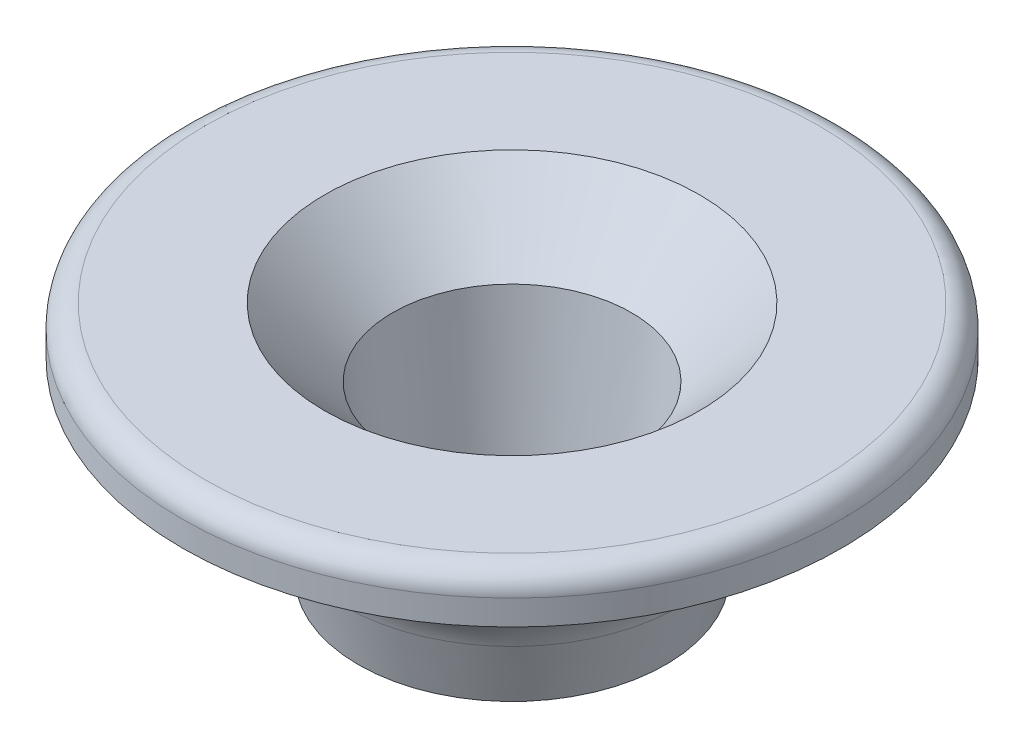
ISO-10303-21;
HEADER;
FILE_DESCRIPTION(('STEP AP214'),'2;1');
FILE_NAME('part.step','',(''),(''),'','','');
FILE_SCHEMA(('AUTOMOTIVE_DESIGN { 1 0 10303 214 1 1 1 1 }'));
ENDSEC;
DATA;
#1=APPLICATION_CONTEXT('core data for automotive mechanical design processes');
#2=APPLICATION_PROTOCOL_DEFINITION('international standard','automotive_design',2000,#1);
#3=PRODUCT_CONTEXT('',#1,'mechanical');
#4=PRODUCT('Part','Part','',(#3));
#5=PRODUCT_RELATED_PRODUCT_CATEGORY('part','',(#4));
#6=PRODUCT_DEFINITION_FORMATION('','',#4);
#7=PRODUCT_DEFINITION_CONTEXT('part definition',#1,'design');
#8=PRODUCT_DEFINITION('design','',#6,#7);
#9=PRODUCT_DEFINITION_SHAPE('','',#8);
#10=(LENGTH_UNIT() NAMED_UNIT(*) SI_UNIT(.MILLI.,.METRE.));
#11=(NAMED_UNIT(*) PLANE_ANGLE_UNIT() SI_UNIT($,.RADIAN.));
#12=(NAMED_UNIT(*) SI_UNIT($,.STERADIAN.) SOLID_ANGLE_UNIT());
#13=UNCERTAINTY_MEASURE_WITH_UNIT(LENGTH_MEASURE(1.E-05),#10,'distance_accuracy_value','');
#14=(GEOMETRIC_REPRESENTATION_CONTEXT(3) GLOBAL_UNCERTAINTY_ASSIGNED_CONTEXT((#13)) GLOBAL_UNIT_ASSIGNED_CONTEXT((#10,
#11,#12)) REPRESENTATION_CONTEXT('',''));
#15=CARTESIAN_POINT('',(0.,0.,0.));
#16=DIRECTION('',(0.,0.,1.));
#17=DIRECTION('',(1.,0.,0.));
#18=AXIS2_PLACEMENT_3D('',#15,#16,#17);
#19=CARTESIAN_POINT('',(0.,3.8884018101044,0.));
#20=DIRECTION('',(0.,1.,0.));
#21=DIRECTION('',(0.,0.,1.));
#22=AXIS2_PLACEMENT_3D('',#19,#20,#21);
#23=CONICAL_SURFACE('',#22,4.4,0.114363653422904);
#24=CARTESIAN_POINT('',(0.,4.44545907102091,0.));
#25=DIRECTION('',(0.,-1.,0.));
#26=DIRECTION('',(0.,0.,-1.));
#27=AXIS2_PLACEMENT_3D('',#24,#25,#26);
#28=CIRCLE('',#27,4.46398630699716);
#29=CARTESIAN_POINT('',(0.,4.44545907102091,-4.46398630699716));
#30=VERTEX_POINT('',#29);
#31=EDGE_CURVE('E50',#30,#30,#28,.T.);
#32=ORIENTED_EDGE('',*,*,#31,.T.);
#33=EDGE_LOOP('',(#32));
#34=FACE_BOUND('',#33,.T.);
#35=CARTESIAN_POINT('',(0.,11.2884018101044,0.));
#36=DIRECTION('',(0.,1.,0.));
#37=DIRECTION('',(0.,0.,1.));
#38=AXIS2_PLACEMENT_3D('',#35,#36,#37);
#39=CIRCLE('',#38,5.25);
#40=CARTESIAN_POINT('',(0.,11.2884018101044,5.25));
#41=VERTEX_POINT('',#40);
#42=EDGE_CURVE('E69',#41,#41,#39,.T.);
#43=ORIENTED_EDGE('',*,*,#42,.T.);
#44=EDGE_LOOP('',(#43));
#45=FACE_BOUND('',#44,.T.);
#46=ADVANCED_FACE('F37',(#34,#45),#23,.F.);
#47=CARTESIAN_POINT('',(0.,11.2884018101044,0.));
#48=DIRECTION('',(0.,1.,0.));
#49=DIRECTION('',(0.,0.,1.));
#50=AXIS2_PLACEMENT_3D('',#47,#48,#49);
#51=CONICAL_SURFACE('',#50,5.25,0.782053694261976);
#52=CARTESIAN_POINT('',(0.,14.2884018101044,0.));
#53=DIRECTION('',(0.,1.,0.));
#54=DIRECTION('',(0.,0.,1.));
#55=AXIS2_PLACEMENT_3D('',#52,#53,#54);
#56=CIRCLE('',#55,8.23);
#57=CARTESIAN_POINT('',(0.,14.2884018101044,8.23));
#58=VERTEX_POINT('',#57);
#59=EDGE_CURVE('E73',#58,#58,#56,.T.);
#60=ORIENTED_EDGE('',*,*,#59,.T.);
#61=EDGE_LOOP('',(#60));
#62=FACE_BOUND('',#61,.T.);
#63=ORIENTED_EDGE('',*,*,#42,.F.);
#64=EDGE_LOOP('',(#63));
#65=FACE_BOUND('',#64,.T.);
#66=ADVANCED_FACE('F112',(#62,#65),#51,.F.);
#67=CARTESIAN_POINT('',(-8.23,14.2884018101044,0.));
#68=DIRECTION('',(0.,1.,0.));
#69=DIRECTION('',(0.,0.,1.));
#70=AXIS2_PLACEMENT_3D('',#67,#68,#69);
#71=PLANE('',#70);
#72=CARTESIAN_POINT('',(0.,14.2884018101044,0.));
#73=DIRECTION('',(0.,1.,0.));
#74=DIRECTION('',(0.,0.,1.));
#75=AXIS2_PLACEMENT_3D('',#72,#73,#74);
#76=CIRCLE('',#75,13.48);
#77=CARTESIAN_POINT('',(0.,14.2884018101044,13.48));
#78=VERTEX_POINT('',#77);
#79=EDGE_CURVE('E45',#78,#78,#76,.T.);
#80=ORIENTED_EDGE('',*,*,#79,.T.);
#81=EDGE_LOOP('',(#80));
#82=FACE_BOUND('',#81,.T.);
#83=ORIENTED_EDGE('',*,*,#59,.F.);
#84=EDGE_LOOP('',(#83));
#85=FACE_BOUND('',#84,.T.);
#86=ADVANCED_FACE('F118',(#82,#85),#71,.T.);
#87=CARTESIAN_POINT('',(0.,31.9985428253133,0.));
#88=DIRECTION('',(0.,1.,0.));
#89=DIRECTION('',(0.,0.,1.));
#90=AXIS2_PLACEMENT_3D('',#87,#88,#89);
#91=CYLINDRICAL_SURFACE('',#90,14.48);
#92=CARTESIAN_POINT('',(0.,13.2884018101044,0.));
#93=DIRECTION('',(0.,1.,0.));
#94=DIRECTION('',(0.,0.,1.));
#95=AXIS2_PLACEMENT_3D('',#92,#93,#94);
#96=CIRCLE('',#95,14.48);
#97=CARTESIAN_POINT('',(0.,13.2884018101044,14.48));
#98=VERTEX_POINT('',#97);
#99=EDGE_CURVE('E10',#98,#98,#96,.F.);
#100=ORIENTED_EDGE('',*,*,#99,.T.);
#101=EDGE_LOOP('',(#100));
#102=FACE_BOUND('',#101,.T.);
#103=CARTESIAN_POINT('',(0.,12.1884018101044,0.));
#104=DIRECTION('',(0.,1.,0.));
#105=DIRECTION('',(0.,0.,1.));
#106=AXIS2_PLACEMENT_3D('',#103,#104,#105);
#107=CIRCLE('',#106,14.48);
#108=CARTESIAN_POINT('',(0.,12.1884018101044,14.48));
#109=VERTEX_POINT('',#108);
#110=EDGE_CURVE('E77',#109,#109,#107,.T.);
#111=ORIENTED_EDGE('',*,*,#110,.T.);
#112=EDGE_LOOP('',(#111));
#113=FACE_BOUND('',#112,.T.);
#114=ADVANCED_FACE('F141',(#102,#113),#91,.T.);
#115=CARTESIAN_POINT('',(-14.48,12.1884018101044,0.));
#116=DIRECTION('',(0.,-1.,0.));
#117=DIRECTION('',(0.,0.,-1.));
#118=AXIS2_PLACEMENT_3D('',#115,#116,#117);
#119=PLANE('',#118);
#120=CARTESIAN_POINT('',(0.,12.1884018101044,0.));
#121=DIRECTION('',(0.,1.,0.));
#122=DIRECTION('',(0.,0.,1.));
#123=AXIS2_PLACEMENT_3D('',#120,#121,#122);
#124=CIRCLE('',#123,10.48);
#125=CARTESIAN_POINT('',(0.,12.1884018101044,10.48));
#126=VERTEX_POINT('',#125);
#127=EDGE_CURVE('E81',#126,#126,#124,.T.);
#128=ORIENTED_EDGE('',*,*,#127,.T.);
#129=EDGE_LOOP('',(#128));
#130=FACE_BOUND('',#129,.T.);
#131=ORIENTED_EDGE('',*,*,#110,.F.);
#132=EDGE_LOOP('',(#131));
#133=FACE_BOUND('',#132,.T.);
#134=ADVANCED_FACE('F146',(#130,#133),#119,.T.);
#135=CARTESIAN_POINT('',(0.,31.9985428253133,0.));
#136=DIRECTION('',(0.,1.,0.));
#137=DIRECTION('',(0.,0.,1.));
#138=AXIS2_PLACEMENT_3D('',#135,#136,#137);
#139=CYLINDRICAL_SURFACE('',#138,10.48);
#140=CARTESIAN_POINT('',(0.,9.7884018101044,0.));
#141=DIRECTION('',(0.,1.,0.));
#142=DIRECTION('',(0.,0.,1.));
#143=AXIS2_PLACEMENT_3D('',#140,#141,#142);
#144=CIRCLE('',#143,10.48);
#145=CARTESIAN_POINT('',(0.,9.7884018101044,10.48));
#146=VERTEX_POINT('',#145);
#147=EDGE_CURVE('E85',#146,#146,#144,.T.);
#148=ORIENTED_EDGE('',*,*,#147,.T.);
#149=EDGE_LOOP('',(#148));
#150=FACE_BOUND('',#149,.T.);
#151=ORIENTED_EDGE('',*,*,#127,.F.);
#152=EDGE_LOOP('',(#151));
#153=FACE_BOUND('',#152,.T.);
#154=ADVANCED_FACE('F188',(#150,#153),#139,.T.);
#155=CARTESIAN_POINT('',(0.,9.7884018101044,0.));
#156=DIRECTION('',(0.,1.,0.));
#157=DIRECTION('',(0.,0.,1.));
#158=AXIS2_PLACEMENT_3D('',#155,#156,#157);
#159=CONICAL_SURFACE('',#158,10.48,0.96277971538216);
#160=CARTESIAN_POINT('',(0.,8.74560124881433,0.));
#161=DIRECTION('',(0.,1.,0.));
#162=DIRECTION('',(0.,0.,1.));
#163=AXIS2_PLACEMENT_3D('',#160,#161,#162);
#164=CIRCLE('',#163,8.98166024614637);
#165=CARTESIAN_POINT('',(0.,8.74560124881433,8.98166024614637));
#166=VERTEX_POINT('',#165);
#167=EDGE_CURVE('E65',#166,#166,#164,.T.);
#168=ORIENTED_EDGE('',*,*,#167,.T.);
#169=EDGE_LOOP('',(#168));
#170=FACE_BOUND('',#169,.T.);
#171=ORIENTED_EDGE('',*,*,#147,.F.);
#172=EDGE_LOOP('',(#171));
#173=FACE_BOUND('',#172,.T.);
#174=ADVANCED_FACE('F108',(#170,#173),#159,.T.);
#175=CARTESIAN_POINT('',(0.,7.8884018101044,0.));
#176=DIRECTION('',(0.,1.,0.));
#177=DIRECTION('',(0.,0.,1.));
#178=AXIS2_PLACEMENT_3D('',#175,#176,#177);
#179=CONICAL_SURFACE('',#178,7.75,0.244978663126864);
#180=CARTESIAN_POINT('',(0.,6.4326132541383,0.));
#181=DIRECTION('',(0.,1.,0.));
#182=DIRECTION('',(0.,0.,1.));
#183=AXIS2_PLACEMENT_3D('',#180,#181,#182);
#184=CIRCLE('',#183,7.38605286100847);
#185=CARTESIAN_POINT('',(0.,6.4326132541383,7.38605286100847));
#186=VERTEX_POINT('',#185);
#187=EDGE_CURVE('E61',#186,#186,#184,.F.);
#188=ORIENTED_EDGE('',*,*,#187,.T.);
#189=EDGE_LOOP('',(#188));
#190=FACE_BOUND('',#189,.T.);
#191=CARTESIAN_POINT('',(0.,3.8884018101044,0.));
#192=DIRECTION('',(0.,1.,0.));
#193=DIRECTION('',(0.,0.,1.));
#194=AXIS2_PLACEMENT_3D('',#191,#192,#193);
#195=CIRCLE('',#194,6.75);
#196=CARTESIAN_POINT('',(0.,3.8884018101044,6.75));
#197=VERTEX_POINT('',#196);
#198=EDGE_CURVE('E89',#197,#197,#195,.T.);
#199=ORIENTED_EDGE('',*,*,#198,.T.);
#200=EDGE_LOOP('',(#199));
#201=FACE_BOUND('',#200,.T.);
#202=ADVANCED_FACE('F94',(#190,#201),#179,.T.);
#203=CARTESIAN_POINT('',(-4.4,3.8884018101044,0.));
#204=DIRECTION('',(0.,-1.,0.));
#205=DIRECTION('',(0.,0.,-1.));
#206=AXIS2_PLACEMENT_3D('',#203,#204,#205);
#207=PLANE('',#206);
#208=CARTESIAN_POINT('',(0.,3.8884018101044,0.));
#209=DIRECTION('',(0.,-1.,0.));
#210=DIRECTION('',(0.,0.,-1.));
#211=AXIS2_PLACEMENT_3D('',#208,#209,#210);
#212=CIRCLE('',#211,4.96072010791744);
#213=CARTESIAN_POINT('',(0.,3.8884018101044,-4.96072010791744));
#214=VERTEX_POINT('',#213);
#215=EDGE_CURVE('E55',#214,#214,#212,.F.);
#216=ORIENTED_EDGE('',*,*,#215,.T.);
#217=EDGE_LOOP('',(#216));
#218=FACE_BOUND('',#217,.T.);
#219=ORIENTED_EDGE('',*,*,#198,.F.);
#220=EDGE_LOOP('',(#219));
#221=FACE_BOUND('',#220,.T.);
#222=ADVANCED_FACE('F96',(#218,#221),#207,.T.);
#223=CARTESIAN_POINT('',(0.,5.46247075399297,0.));
#224=DIRECTION('',(0.,1.,0.));
#225=DIRECTION('',(0.,0.,1.));
#226=AXIS2_PLACEMENT_3D('',#223,#224,#225);
#227=TOROIDAL_SURFACE('',#226,11.2666228615898,4.);
#228=ORIENTED_EDGE('',*,*,#187,.F.);
#229=EDGE_LOOP('',(#228));
#230=FACE_BOUND('',#229,.T.);
#231=ORIENTED_EDGE('',*,*,#167,.F.);
#232=EDGE_LOOP('',(#231));
#233=FACE_BOUND('',#232,.T.);
#234=ADVANCED_FACE('F98',(#230,#233),#227,.F.);
#235=CARTESIAN_POINT('',(0.,4.3884018101044,0.));
#236=DIRECTION('',(0.,-1.,0.));
#237=DIRECTION('',(0.,0.,-1.));
#238=AXIS2_PLACEMENT_3D('',#235,#236,#237);
#239=TOROIDAL_SURFACE('',#238,4.96072010791744,0.5);
#240=ORIENTED_EDGE('',*,*,#31,.F.);
#241=EDGE_LOOP('',(#240));
#242=FACE_BOUND('',#241,.T.);
#243=ORIENTED_EDGE('',*,*,#215,.F.);
#244=EDGE_LOOP('',(#243));
#245=FACE_BOUND('',#244,.T.);
#246=ADVANCED_FACE('F105',(#242,#245),#239,.T.);
#247=CARTESIAN_POINT('',(0.,13.2884018101044,0.));
#248=DIRECTION('',(0.,1.,0.));
#249=DIRECTION('',(0.,0.,1.));
#250=AXIS2_PLACEMENT_3D('',#247,#248,#249);
#251=TOROIDAL_SURFACE('',#250,13.48,1.);
#252=ORIENTED_EDGE('',*,*,#99,.F.);
#253=EDGE_LOOP('',(#252));
#254=FACE_BOUND('',#253,.T.);
#255=ORIENTED_EDGE('',*,*,#79,.F.);
#256=EDGE_LOOP('',(#255));
#257=FACE_BOUND('',#256,.T.);
#258=ADVANCED_FACE('F39',(#254,#257),#251,.T.);
#259=CLOSED_SHELL('',(#46,#66,#86,#114,#134,#154,#174,#202,#222,#234,#246,#258));
#260=MANIFOLD_SOLID_BREP('B2',#259);
#261=ADVANCED_BREP_SHAPE_REPRESENTATION('',(#18,#260),#14);
#262=SHAPE_DEFINITION_REPRESENTATION(#9,#261);
ENDSEC;
END-ISO-10303-21;
